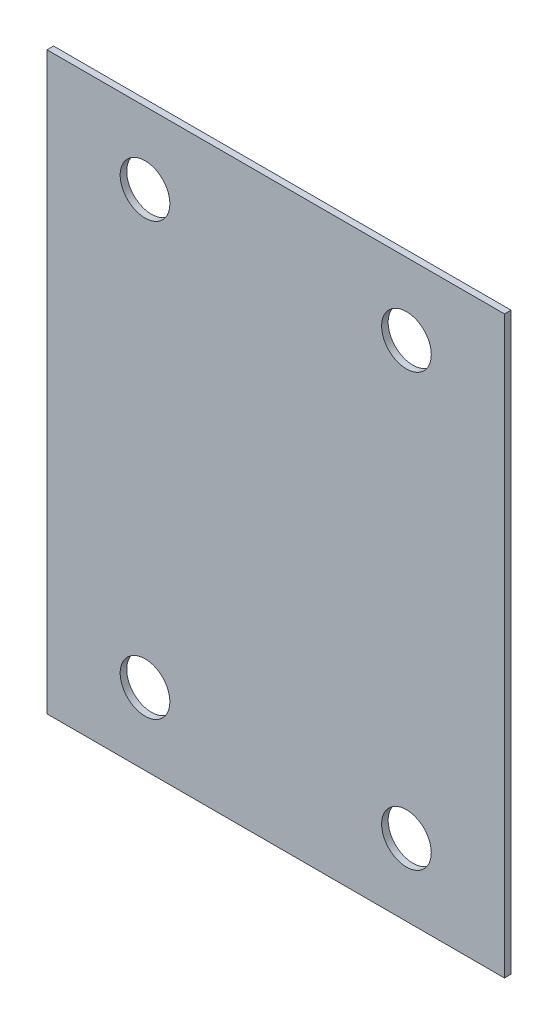
ISO-10303-21;
HEADER;
FILE_DESCRIPTION(('STEP AP214'),'2;1');
FILE_NAME('part.step','',(''),(''),'','','');
FILE_SCHEMA(('AUTOMOTIVE_DESIGN { 1 0 10303 214 1 1 1 1 }'));
ENDSEC;
DATA;
#1=APPLICATION_CONTEXT('core data for automotive mechanical design processes');
#2=APPLICATION_PROTOCOL_DEFINITION('international standard','automotive_design',2000,#1);
#3=PRODUCT_CONTEXT('',#1,'mechanical');
#4=PRODUCT('Part','Part','',(#3));
#5=PRODUCT_RELATED_PRODUCT_CATEGORY('part','',(#4));
#6=PRODUCT_DEFINITION_FORMATION('','',#4);
#7=PRODUCT_DEFINITION_CONTEXT('part definition',#1,'design');
#8=PRODUCT_DEFINITION('design','',#6,#7);
#9=PRODUCT_DEFINITION_SHAPE('','',#8);
#10=(LENGTH_UNIT() NAMED_UNIT(*) SI_UNIT(.MILLI.,.METRE.));
#11=(NAMED_UNIT(*) PLANE_ANGLE_UNIT() SI_UNIT($,.RADIAN.));
#12=(NAMED_UNIT(*) SI_UNIT($,.STERADIAN.) SOLID_ANGLE_UNIT());
#13=UNCERTAINTY_MEASURE_WITH_UNIT(LENGTH_MEASURE(1.E-05),#10,'distance_accuracy_value','');
#14=(GEOMETRIC_REPRESENTATION_CONTEXT(3) GLOBAL_UNCERTAINTY_ASSIGNED_CONTEXT((#13)) GLOBAL_UNIT_ASSIGNED_CONTEXT((#10,
#11,#12)) REPRESENTATION_CONTEXT('',''));
#15=CARTESIAN_POINT('',(0.,0.,0.));
#16=DIRECTION('',(0.,0.,1.));
#17=DIRECTION('',(1.,0.,0.));
#18=AXIS2_PLACEMENT_3D('',#15,#16,#17);
#19=CARTESIAN_POINT('',(0.,0.,5.));
#20=DIRECTION('',(0.,0.,1.));
#21=DIRECTION('',(1.,0.,0.));
#22=AXIS2_PLACEMENT_3D('',#19,#20,#21);
#23=PLANE('',#22);
#24=CARTESIAN_POINT('',(100.,-165.,5.));
#25=DIRECTION('',(0.,0.,1.));
#26=DIRECTION('',(1.,0.,0.));
#27=AXIS2_PLACEMENT_3D('',#24,#25,#26);
#28=CIRCLE('',#27,19.);
#29=CARTESIAN_POINT('',(119.,-165.,5.));
#30=VERTEX_POINT('',#29);
#31=EDGE_CURVE('E121',#30,#30,#28,.T.);
#32=ORIENTED_EDGE('',*,*,#31,.F.);
#33=EDGE_LOOP('',(#32));
#34=FACE_BOUND('',#33,.T.);
#35=CARTESIAN_POINT('',(-100.,165.,5.));
#36=DIRECTION('',(0.,0.,1.));
#37=DIRECTION('',(1.,0.,0.));
#38=AXIS2_PLACEMENT_3D('',#35,#36,#37);
#39=CIRCLE('',#38,19.0000000000034);
#40=CARTESIAN_POINT('',(-80.9999999999966,165.,5.));
#41=VERTEX_POINT('',#40);
#42=EDGE_CURVE('E100',#41,#41,#39,.T.);
#43=ORIENTED_EDGE('',*,*,#42,.F.);
#44=EDGE_LOOP('',(#43));
#45=FACE_BOUND('',#44,.T.);
#46=DIRECTION('',(1.,0.,0.));
#47=VECTOR('',#46,1.);
#48=CARTESIAN_POINT('',(-175.,-220.,5.));
#49=LINE('',#48,#47);
#50=CARTESIAN_POINT('',(-175.,-220.,5.));
#51=VERTEX_POINT('',#50);
#52=CARTESIAN_POINT('',(175.,-220.,5.));
#53=VERTEX_POINT('',#52);
#54=EDGE_CURVE('E85',#51,#53,#49,.T.);
#55=ORIENTED_EDGE('',*,*,#54,.T.);
#56=DIRECTION('',(0.,1.,0.));
#57=VECTOR('',#56,1.);
#58=CARTESIAN_POINT('',(175.,-220.,5.));
#59=LINE('',#58,#57);
#60=CARTESIAN_POINT('',(175.,220.,5.));
#61=VERTEX_POINT('',#60);
#62=EDGE_CURVE('E80',#53,#61,#59,.T.);
#63=ORIENTED_EDGE('',*,*,#62,.T.);
#64=DIRECTION('',(-1.,0.,0.));
#65=VECTOR('',#64,1.);
#66=CARTESIAN_POINT('',(175.,220.,5.));
#67=LINE('',#66,#65);
#68=CARTESIAN_POINT('',(-175.,220.,5.));
#69=VERTEX_POINT('',#68);
#70=EDGE_CURVE('E83',#61,#69,#67,.T.);
#71=ORIENTED_EDGE('',*,*,#70,.T.);
#72=DIRECTION('',(0.,-1.,0.));
#73=VECTOR('',#72,1.);
#74=CARTESIAN_POINT('',(-175.,220.,5.));
#75=LINE('',#74,#73);
#76=EDGE_CURVE('E50',#69,#51,#75,.T.);
#77=ORIENTED_EDGE('',*,*,#76,.T.);
#78=EDGE_LOOP('',(#55,#63,#71,#77));
#79=FACE_BOUND('',#78,.T.);
#80=CARTESIAN_POINT('',(100.,165.,5.));
#81=DIRECTION('',(0.,0.,1.));
#82=DIRECTION('',(1.,0.,0.));
#83=AXIS2_PLACEMENT_3D('',#80,#81,#82);
#84=CIRCLE('',#83,18.999999999996);
#85=CARTESIAN_POINT('',(118.999999999996,165.,5.));
#86=VERTEX_POINT('',#85);
#87=EDGE_CURVE('E115',#86,#86,#84,.T.);
#88=ORIENTED_EDGE('',*,*,#87,.F.);
#89=EDGE_LOOP('',(#88));
#90=FACE_BOUND('',#89,.T.);
#91=CARTESIAN_POINT('',(-100.,-165.,5.));
#92=DIRECTION('',(0.,0.,1.));
#93=DIRECTION('',(1.,0.,0.));
#94=AXIS2_PLACEMENT_3D('',#91,#92,#93);
#95=CIRCLE('',#94,19.);
#96=CARTESIAN_POINT('',(-81.,-165.,5.));
#97=VERTEX_POINT('',#96);
#98=EDGE_CURVE('E127',#97,#97,#95,.T.);
#99=ORIENTED_EDGE('',*,*,#98,.F.);
#100=EDGE_LOOP('',(#99));
#101=FACE_BOUND('',#100,.T.);
#102=ADVANCED_FACE('F33',(#34,#45,#79,#90,#101),#23,.T.);
#103=CARTESIAN_POINT('',(0.,0.,0.));
#104=DIRECTION('',(0.,0.,1.));
#105=DIRECTION('',(1.,0.,0.));
#106=AXIS2_PLACEMENT_3D('',#103,#104,#105);
#107=PLANE('',#106);
#108=DIRECTION('',(1.,0.,0.));
#109=VECTOR('',#108,1.);
#110=CARTESIAN_POINT('',(-175.,-220.,0.));
#111=LINE('',#110,#109);
#112=CARTESIAN_POINT('',(-175.,-220.,0.));
#113=VERTEX_POINT('',#112);
#114=CARTESIAN_POINT('',(175.,-220.,0.));
#115=VERTEX_POINT('',#114);
#116=EDGE_CURVE('E97',#113,#115,#111,.T.);
#117=ORIENTED_EDGE('',*,*,#116,.F.);
#118=DIRECTION('',(0.,-1.,0.));
#119=VECTOR('',#118,1.);
#120=CARTESIAN_POINT('',(-175.,220.,0.));
#121=LINE('',#120,#119);
#122=CARTESIAN_POINT('',(-175.,220.,0.));
#123=VERTEX_POINT('',#122);
#124=EDGE_CURVE('E73',#123,#113,#121,.T.);
#125=ORIENTED_EDGE('',*,*,#124,.F.);
#126=DIRECTION('',(-1.,0.,0.));
#127=VECTOR('',#126,1.);
#128=CARTESIAN_POINT('',(175.,220.,0.));
#129=LINE('',#128,#127);
#130=CARTESIAN_POINT('',(175.,220.,0.));
#131=VERTEX_POINT('',#130);
#132=EDGE_CURVE('E67',#131,#123,#129,.T.);
#133=ORIENTED_EDGE('',*,*,#132,.F.);
#134=DIRECTION('',(0.,1.,0.));
#135=VECTOR('',#134,1.);
#136=CARTESIAN_POINT('',(175.,-220.,0.));
#137=LINE('',#136,#135);
#138=EDGE_CURVE('E89',#115,#131,#137,.T.);
#139=ORIENTED_EDGE('',*,*,#138,.F.);
#140=EDGE_LOOP('',(#117,#125,#133,#139));
#141=FACE_BOUND('',#140,.T.);
#142=CARTESIAN_POINT('',(-100.,165.,0.));
#143=DIRECTION('',(0.,0.,1.));
#144=DIRECTION('',(1.,0.,0.));
#145=AXIS2_PLACEMENT_3D('',#142,#143,#144);
#146=CIRCLE('',#145,19.0000000000034);
#147=CARTESIAN_POINT('',(-80.9999999999966,165.,0.));
#148=VERTEX_POINT('',#147);
#149=EDGE_CURVE('E112',#148,#148,#146,.T.);
#150=ORIENTED_EDGE('',*,*,#149,.T.);
#151=EDGE_LOOP('',(#150));
#152=FACE_BOUND('',#151,.T.);
#153=CARTESIAN_POINT('',(100.,165.,0.));
#154=DIRECTION('',(0.,0.,1.));
#155=DIRECTION('',(1.,0.,0.));
#156=AXIS2_PLACEMENT_3D('',#153,#154,#155);
#157=CIRCLE('',#156,18.999999999996);
#158=CARTESIAN_POINT('',(118.999999999996,165.,0.));
#159=VERTEX_POINT('',#158);
#160=EDGE_CURVE('E118',#159,#159,#157,.T.);
#161=ORIENTED_EDGE('',*,*,#160,.T.);
#162=EDGE_LOOP('',(#161));
#163=FACE_BOUND('',#162,.T.);
#164=CARTESIAN_POINT('',(100.,-165.,0.));
#165=DIRECTION('',(0.,0.,1.));
#166=DIRECTION('',(1.,0.,0.));
#167=AXIS2_PLACEMENT_3D('',#164,#165,#166);
#168=CIRCLE('',#167,19.);
#169=CARTESIAN_POINT('',(119.,-165.,0.));
#170=VERTEX_POINT('',#169);
#171=EDGE_CURVE('E124',#170,#170,#168,.T.);
#172=ORIENTED_EDGE('',*,*,#171,.T.);
#173=EDGE_LOOP('',(#172));
#174=FACE_BOUND('',#173,.T.);
#175=CARTESIAN_POINT('',(-100.,-165.,0.));
#176=DIRECTION('',(0.,0.,1.));
#177=DIRECTION('',(1.,0.,0.));
#178=AXIS2_PLACEMENT_3D('',#175,#176,#177);
#179=CIRCLE('',#178,19.);
#180=CARTESIAN_POINT('',(-81.,-165.,0.));
#181=VERTEX_POINT('',#180);
#182=EDGE_CURVE('E130',#181,#181,#179,.T.);
#183=ORIENTED_EDGE('',*,*,#182,.T.);
#184=EDGE_LOOP('',(#183));
#185=FACE_BOUND('',#184,.T.);
#186=ADVANCED_FACE('F108',(#141,#152,#163,#174,#185),#107,.F.);
#187=CARTESIAN_POINT('',(-175.,-220.,5.));
#188=DIRECTION('',(0.,1.,0.));
#189=DIRECTION('',(0.,0.,1.));
#190=AXIS2_PLACEMENT_3D('',#187,#188,#189);
#191=PLANE('',#190);
#192=ORIENTED_EDGE('',*,*,#116,.T.);
#193=DIRECTION('',(0.,0.,-1.));
#194=VECTOR('',#193,1.);
#195=CARTESIAN_POINT('',(175.,-220.,5.));
#196=LINE('',#195,#194);
#197=EDGE_CURVE('E11',#53,#115,#196,.T.);
#198=ORIENTED_EDGE('',*,*,#197,.F.);
#199=ORIENTED_EDGE('',*,*,#54,.F.);
#200=DIRECTION('',(0.,0.,-1.));
#201=VECTOR('',#200,1.);
#202=CARTESIAN_POINT('',(-175.,-220.,5.));
#203=LINE('',#202,#201);
#204=EDGE_CURVE('E93',#51,#113,#203,.T.);
#205=ORIENTED_EDGE('',*,*,#204,.T.);
#206=EDGE_LOOP('',(#192,#198,#199,#205));
#207=FACE_BOUND('',#206,.T.);
#208=ADVANCED_FACE('F35',(#207),#191,.F.);
#209=CARTESIAN_POINT('',(175.,-220.,5.));
#210=DIRECTION('',(-1.,0.,0.));
#211=DIRECTION('',(0.,0.,1.));
#212=AXIS2_PLACEMENT_3D('',#209,#210,#211);
#213=PLANE('',#212);
#214=ORIENTED_EDGE('',*,*,#138,.T.);
#215=DIRECTION('',(0.,0.,-1.));
#216=VECTOR('',#215,1.);
#217=CARTESIAN_POINT('',(175.,220.,5.));
#218=LINE('',#217,#216);
#219=EDGE_CURVE('E42',#61,#131,#218,.T.);
#220=ORIENTED_EDGE('',*,*,#219,.F.);
#221=ORIENTED_EDGE('',*,*,#62,.F.);
#222=ORIENTED_EDGE('',*,*,#197,.T.);
#223=EDGE_LOOP('',(#214,#220,#221,#222));
#224=FACE_BOUND('',#223,.T.);
#225=ADVANCED_FACE('F88',(#224),#213,.F.);
#226=CARTESIAN_POINT('',(175.,220.,5.));
#227=DIRECTION('',(0.,-1.,0.));
#228=DIRECTION('',(0.,0.,-1.));
#229=AXIS2_PLACEMENT_3D('',#226,#227,#228);
#230=PLANE('',#229);
#231=ORIENTED_EDGE('',*,*,#132,.T.);
#232=DIRECTION('',(0.,0.,-1.));
#233=VECTOR('',#232,1.);
#234=CARTESIAN_POINT('',(-175.,220.,5.));
#235=LINE('',#234,#233);
#236=EDGE_CURVE('E90',#69,#123,#235,.T.);
#237=ORIENTED_EDGE('',*,*,#236,.F.);
#238=ORIENTED_EDGE('',*,*,#70,.F.);
#239=ORIENTED_EDGE('',*,*,#219,.T.);
#240=EDGE_LOOP('',(#231,#237,#238,#239));
#241=FACE_BOUND('',#240,.T.);
#242=ADVANCED_FACE('F91',(#241),#230,.F.);
#243=CARTESIAN_POINT('',(-175.,220.,5.));
#244=DIRECTION('',(1.,0.,0.));
#245=DIRECTION('',(0.,0.,-1.));
#246=AXIS2_PLACEMENT_3D('',#243,#244,#245);
#247=PLANE('',#246);
#248=ORIENTED_EDGE('',*,*,#124,.T.);
#249=ORIENTED_EDGE('',*,*,#204,.F.);
#250=ORIENTED_EDGE('',*,*,#76,.F.);
#251=ORIENTED_EDGE('',*,*,#236,.T.);
#252=EDGE_LOOP('',(#248,#249,#250,#251));
#253=FACE_BOUND('',#252,.T.);
#254=ADVANCED_FACE('F105',(#253),#247,.F.);
#255=CARTESIAN_POINT('',(-100.,165.,5.));
#256=DIRECTION('',(0.,0.,-1.));
#257=DIRECTION('',(-1.,0.,0.));
#258=AXIS2_PLACEMENT_3D('',#255,#256,#257);
#259=CYLINDRICAL_SURFACE('',#258,19.0000000000034);
#260=ORIENTED_EDGE('',*,*,#42,.T.);
#261=EDGE_LOOP('',(#260));
#262=FACE_BOUND('',#261,.T.);
#263=ORIENTED_EDGE('',*,*,#149,.F.);
#264=EDGE_LOOP('',(#263));
#265=FACE_BOUND('',#264,.T.);
#266=ADVANCED_FACE('F149',(#262,#265),#259,.F.);
#267=CARTESIAN_POINT('',(100.,165.,5.));
#268=DIRECTION('',(0.,0.,-1.));
#269=DIRECTION('',(-1.,0.,0.));
#270=AXIS2_PLACEMENT_3D('',#267,#268,#269);
#271=CYLINDRICAL_SURFACE('',#270,18.999999999996);
#272=ORIENTED_EDGE('',*,*,#87,.T.);
#273=EDGE_LOOP('',(#272));
#274=FACE_BOUND('',#273,.T.);
#275=ORIENTED_EDGE('',*,*,#160,.F.);
#276=EDGE_LOOP('',(#275));
#277=FACE_BOUND('',#276,.T.);
#278=ADVANCED_FACE('F195',(#274,#277),#271,.F.);
#279=CARTESIAN_POINT('',(100.,-165.,5.));
#280=DIRECTION('',(0.,0.,-1.));
#281=DIRECTION('',(-1.,0.,0.));
#282=AXIS2_PLACEMENT_3D('',#279,#280,#281);
#283=CYLINDRICAL_SURFACE('',#282,19.);
#284=ORIENTED_EDGE('',*,*,#31,.T.);
#285=EDGE_LOOP('',(#284));
#286=FACE_BOUND('',#285,.T.);
#287=ORIENTED_EDGE('',*,*,#171,.F.);
#288=EDGE_LOOP('',(#287));
#289=FACE_BOUND('',#288,.T.);
#290=ADVANCED_FACE('F203',(#286,#289),#283,.F.);
#291=CARTESIAN_POINT('',(-100.,-165.,5.));
#292=DIRECTION('',(0.,0.,-1.));
#293=DIRECTION('',(-1.,0.,0.));
#294=AXIS2_PLACEMENT_3D('',#291,#292,#293);
#295=CYLINDRICAL_SURFACE('',#294,19.);
#296=ORIENTED_EDGE('',*,*,#98,.T.);
#297=EDGE_LOOP('',(#296));
#298=FACE_BOUND('',#297,.T.);
#299=ORIENTED_EDGE('',*,*,#182,.F.);
#300=EDGE_LOOP('',(#299));
#301=FACE_BOUND('',#300,.T.);
#302=ADVANCED_FACE('F136',(#298,#301),#295,.F.);
#303=CLOSED_SHELL('',(#102,#186,#208,#225,#242,#254,#266,#278,#290,#302));
#304=MANIFOLD_SOLID_BREP('B2',#303);
#305=ADVANCED_BREP_SHAPE_REPRESENTATION('',(#18,#304),#14);
#306=SHAPE_DEFINITION_REPRESENTATION(#9,#305);
ENDSEC;
END-ISO-10303-21;
